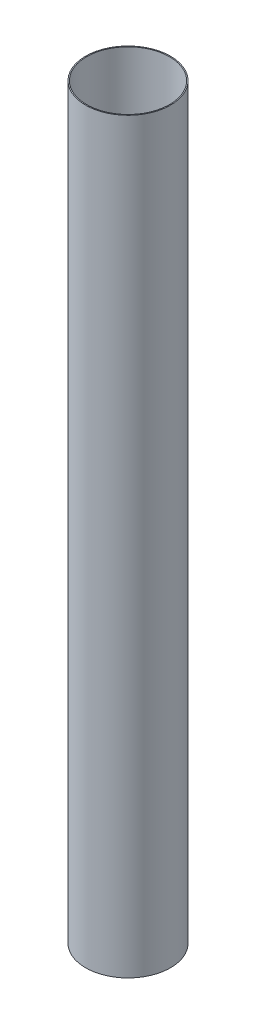
ISO-10303-21;
HEADER;
FILE_DESCRIPTION(('STEP AP214'),'2;1');
FILE_NAME('part.step','',(''),(''),'','','');
FILE_SCHEMA(('AUTOMOTIVE_DESIGN { 1 0 10303 214 1 1 1 1 }'));
ENDSEC;
DATA;
#1=APPLICATION_CONTEXT('core data for automotive mechanical design processes');
#2=APPLICATION_PROTOCOL_DEFINITION('international standard','automotive_design',2000,#1);
#3=PRODUCT_CONTEXT('',#1,'mechanical');
#4=PRODUCT('Part','Part','',(#3));
#5=PRODUCT_RELATED_PRODUCT_CATEGORY('part','',(#4));
#6=PRODUCT_DEFINITION_FORMATION('','',#4);
#7=PRODUCT_DEFINITION_CONTEXT('part definition',#1,'design');
#8=PRODUCT_DEFINITION('design','',#6,#7);
#9=PRODUCT_DEFINITION_SHAPE('','',#8);
#10=(LENGTH_UNIT() NAMED_UNIT(*) SI_UNIT(.MILLI.,.METRE.));
#11=(NAMED_UNIT(*) PLANE_ANGLE_UNIT() SI_UNIT($,.RADIAN.));
#12=(NAMED_UNIT(*) SI_UNIT($,.STERADIAN.) SOLID_ANGLE_UNIT());
#13=UNCERTAINTY_MEASURE_WITH_UNIT(LENGTH_MEASURE(1.E-05),#10,'distance_accuracy_value','');
#14=(GEOMETRIC_REPRESENTATION_CONTEXT(3) GLOBAL_UNCERTAINTY_ASSIGNED_CONTEXT((#13)) GLOBAL_UNIT_ASSIGNED_CONTEXT((#10,
#11,#12)) REPRESENTATION_CONTEXT('',''));
#15=CARTESIAN_POINT('',(0.,0.,0.));
#16=DIRECTION('',(0.,0.,1.));
#17=DIRECTION('',(1.,0.,0.));
#18=AXIS2_PLACEMENT_3D('',#15,#16,#17);
#19=CARTESIAN_POINT('',(0.,-13.97,0.));
#20=DIRECTION('',(0.,-1.,0.));
#21=DIRECTION('',(0.,0.,-1.));
#22=AXIS2_PLACEMENT_3D('',#19,#20,#21);
#23=CYLINDRICAL_SURFACE('',#22,19.0373);
#24=CARTESIAN_POINT('',(0.,0.,0.));
#25=DIRECTION('',(0.,-1.,0.));
#26=DIRECTION('',(0.,0.,-1.));
#27=AXIS2_PLACEMENT_3D('',#24,#25,#26);
#28=CIRCLE('',#27,19.0373);
#29=CARTESIAN_POINT('',(0.,0.,-19.0373));
#30=VERTEX_POINT('',#29);
#31=EDGE_CURVE('E50',#30,#30,#28,.T.);
#32=ORIENTED_EDGE('',*,*,#31,.T.);
#33=EDGE_LOOP('',(#32));
#34=FACE_BOUND('',#33,.T.);
#35=CARTESIAN_POINT('',(0.,342.9,0.));
#36=DIRECTION('',(0.,-1.,0.));
#37=DIRECTION('',(0.,0.,-1.));
#38=AXIS2_PLACEMENT_3D('',#35,#36,#37);
#39=CIRCLE('',#38,19.0373);
#40=CARTESIAN_POINT('',(0.,342.9,-19.0373));
#41=VERTEX_POINT('',#40);
#42=EDGE_CURVE('E10',#41,#41,#39,.T.);
#43=ORIENTED_EDGE('',*,*,#42,.F.);
#44=EDGE_LOOP('',(#43));
#45=FACE_BOUND('',#44,.T.);
#46=ADVANCED_FACE('F36',(#34,#45),#23,.F.);
#47=CARTESIAN_POINT('',(19.0373,342.9,0.));
#48=DIRECTION('',(0.,1.,0.));
#49=DIRECTION('',(0.,0.,1.));
#50=AXIS2_PLACEMENT_3D('',#47,#48,#49);
#51=PLANE('',#50);
#52=ORIENTED_EDGE('',*,*,#42,.T.);
#53=EDGE_LOOP('',(#52));
#54=FACE_BOUND('',#53,.T.);
#55=CARTESIAN_POINT('',(0.,342.9,0.));
#56=DIRECTION('',(0.,-1.,0.));
#57=DIRECTION('',(0.,0.,-1.));
#58=AXIS2_PLACEMENT_3D('',#55,#56,#57);
#59=CIRCLE('',#58,19.4945);
#60=CARTESIAN_POINT('',(0.,342.9,-19.4945));
#61=VERTEX_POINT('',#60);
#62=EDGE_CURVE('E42',#61,#61,#59,.T.);
#63=ORIENTED_EDGE('',*,*,#62,.F.);
#64=EDGE_LOOP('',(#63));
#65=FACE_BOUND('',#64,.T.);
#66=ADVANCED_FACE('F66',(#54,#65),#51,.T.);
#67=CARTESIAN_POINT('',(0.,-13.97,0.));
#68=DIRECTION('',(0.,-1.,0.));
#69=DIRECTION('',(0.,0.,-1.));
#70=AXIS2_PLACEMENT_3D('',#67,#68,#69);
#71=CYLINDRICAL_SURFACE('',#70,19.4945);
#72=ORIENTED_EDGE('',*,*,#62,.T.);
#73=EDGE_LOOP('',(#72));
#74=FACE_BOUND('',#73,.T.);
#75=CARTESIAN_POINT('',(0.,0.,0.));
#76=DIRECTION('',(0.,-1.,0.));
#77=DIRECTION('',(0.,0.,-1.));
#78=AXIS2_PLACEMENT_3D('',#75,#76,#77);
#79=CIRCLE('',#78,19.4945);
#80=CARTESIAN_POINT('',(0.,0.,-19.4945));
#81=VERTEX_POINT('',#80);
#82=EDGE_CURVE('E46',#81,#81,#79,.T.);
#83=ORIENTED_EDGE('',*,*,#82,.F.);
#84=EDGE_LOOP('',(#83));
#85=FACE_BOUND('',#84,.T.);
#86=ADVANCED_FACE('F60',(#74,#85),#71,.T.);
#87=CARTESIAN_POINT('',(19.0373,0.,0.));
#88=DIRECTION('',(0.,-1.,0.));
#89=DIRECTION('',(0.,0.,-1.));
#90=AXIS2_PLACEMENT_3D('',#87,#88,#89);
#91=PLANE('',#90);
#92=ORIENTED_EDGE('',*,*,#82,.T.);
#93=EDGE_LOOP('',(#92));
#94=FACE_BOUND('',#93,.T.);
#95=ORIENTED_EDGE('',*,*,#31,.F.);
#96=EDGE_LOOP('',(#95));
#97=FACE_BOUND('',#96,.T.);
#98=ADVANCED_FACE('F58',(#94,#97),#91,.T.);
#99=CLOSED_SHELL('',(#46,#66,#86,#98));
#100=MANIFOLD_SOLID_BREP('B2',#99);
#101=ADVANCED_BREP_SHAPE_REPRESENTATION('',(#18,#100),#14);
#102=SHAPE_DEFINITION_REPRESENTATION(#9,#101);
ENDSEC;
END-ISO-10303-21;
